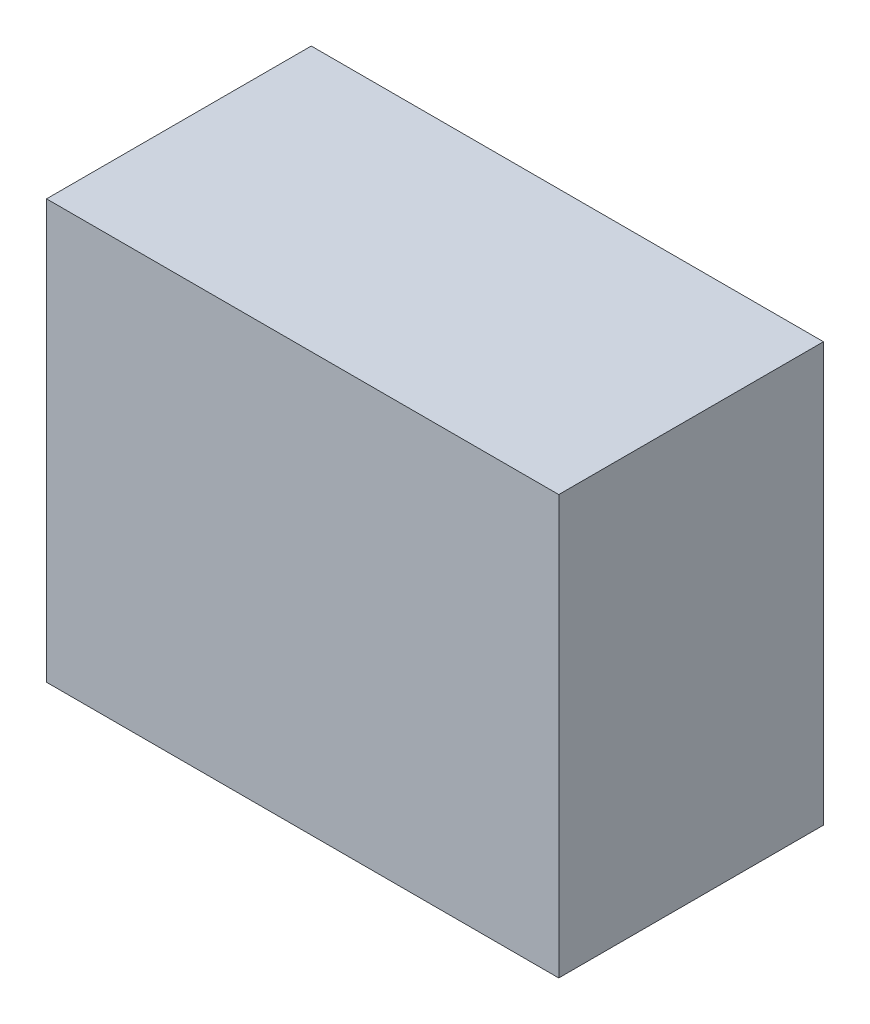
ISO-10303-21;
HEADER;
FILE_DESCRIPTION(('STEP AP214'),'2;1');
FILE_NAME('part.step','',(''),(''),'','','');
FILE_SCHEMA(('AUTOMOTIVE_DESIGN { 1 0 10303 214 1 1 1 1 }'));
ENDSEC;
DATA;
#1=APPLICATION_CONTEXT('core data for automotive mechanical design processes');
#2=APPLICATION_PROTOCOL_DEFINITION('international standard','automotive_design',2000,#1);
#3=PRODUCT_CONTEXT('',#1,'mechanical');
#4=PRODUCT('Part','Part','',(#3));
#5=PRODUCT_RELATED_PRODUCT_CATEGORY('part','',(#4));
#6=PRODUCT_DEFINITION_FORMATION('','',#4);
#7=PRODUCT_DEFINITION_CONTEXT('part definition',#1,'design');
#8=PRODUCT_DEFINITION('design','',#6,#7);
#9=PRODUCT_DEFINITION_SHAPE('','',#8);
#10=(LENGTH_UNIT() NAMED_UNIT(*) SI_UNIT(.MILLI.,.METRE.));
#11=(NAMED_UNIT(*) PLANE_ANGLE_UNIT() SI_UNIT($,.RADIAN.));
#12=(NAMED_UNIT(*) SI_UNIT($,.STERADIAN.) SOLID_ANGLE_UNIT());
#13=UNCERTAINTY_MEASURE_WITH_UNIT(LENGTH_MEASURE(1.E-05),#10,'distance_accuracy_value','');
#14=(GEOMETRIC_REPRESENTATION_CONTEXT(3) GLOBAL_UNCERTAINTY_ASSIGNED_CONTEXT((#13)) GLOBAL_UNIT_ASSIGNED_CONTEXT((#10,
#11,#12)) REPRESENTATION_CONTEXT('',''));
#15=CARTESIAN_POINT('',(0.,0.,0.));
#16=DIRECTION('',(0.,0.,1.));
#17=DIRECTION('',(1.,0.,0.));
#18=AXIS2_PLACEMENT_3D('',#15,#16,#17);
#19=CARTESIAN_POINT('',(-0.58050684,-0.47448978,0.));
#20=DIRECTION('',(-1.,0.,0.));
#21=DIRECTION('',(0.,1.,0.));
#22=AXIS2_PLACEMENT_3D('',#19,#20,#21);
#23=PLANE('',#22);
#24=DIRECTION('',(0.,0.,1.));
#25=VECTOR('',#24,1.);
#26=CARTESIAN_POINT('',(-0.58050684,-0.47448978,0.));
#27=LINE('',#26,#25);
#28=CARTESIAN_POINT('',(-0.58050684,-0.47448978,0.));
#29=VERTEX_POINT('',#28);
#30=CARTESIAN_POINT('',(-0.58050684,-0.47448978,0.5999988));
#31=VERTEX_POINT('',#30);
#32=EDGE_CURVE('E11',#29,#31,#27,.T.);
#33=ORIENTED_EDGE('',*,*,#32,.T.);
#34=DIRECTION('',(0.,1.,0.));
#35=VECTOR('',#34,1.);
#36=CARTESIAN_POINT('',(-0.58050684,-0.47448978,0.5999988));
#37=LINE('',#36,#35);
#38=CARTESIAN_POINT('',(-0.58050684,0.47449232,0.5999988));
#39=VERTEX_POINT('',#38);
#40=EDGE_CURVE('E23',#31,#39,#37,.T.);
#41=ORIENTED_EDGE('',*,*,#40,.T.);
#42=DIRECTION('',(0.,0.,1.));
#43=VECTOR('',#42,1.);
#44=CARTESIAN_POINT('',(-0.58050684,0.47449232,0.));
#45=LINE('',#44,#43);
#46=CARTESIAN_POINT('',(-0.58050684,0.47449232,0.));
#47=VERTEX_POINT('',#46);
#48=EDGE_CURVE('E84',#47,#39,#45,.T.);
#49=ORIENTED_EDGE('',*,*,#48,.F.);
#50=DIRECTION('',(0.,1.,0.));
#51=VECTOR('',#50,1.);
#52=CARTESIAN_POINT('',(-0.58050684,-0.47448978,0.));
#53=LINE('',#52,#51);
#54=EDGE_CURVE('E82',#29,#47,#53,.T.);
#55=ORIENTED_EDGE('',*,*,#54,.F.);
#56=EDGE_LOOP('',(#33,#41,#49,#55));
#57=FACE_BOUND('',#56,.T.);
#58=ADVANCED_FACE('F16',(#57),#23,.T.);
#59=CARTESIAN_POINT('',(-0.58050684,0.47449232,0.));
#60=DIRECTION('',(0.,1.,0.));
#61=DIRECTION('',(1.,0.,0.));
#62=AXIS2_PLACEMENT_3D('',#59,#60,#61);
#63=PLANE('',#62);
#64=ORIENTED_EDGE('',*,*,#48,.T.);
#65=DIRECTION('',(1.,0.,0.));
#66=VECTOR('',#65,1.);
#67=CARTESIAN_POINT('',(-0.58050684,0.47449232,0.5999988));
#68=LINE('',#67,#66);
#69=CARTESIAN_POINT('',(0.58050684,0.47449232,0.5999988));
#70=VERTEX_POINT('',#69);
#71=EDGE_CURVE('E80',#39,#70,#68,.T.);
#72=ORIENTED_EDGE('',*,*,#71,.T.);
#73=DIRECTION('',(0.,0.,1.));
#74=VECTOR('',#73,1.);
#75=CARTESIAN_POINT('',(0.58050684,0.47449232,0.));
#76=LINE('',#75,#74);
#77=CARTESIAN_POINT('',(0.58050684,0.47449232,0.));
#78=VERTEX_POINT('',#77);
#79=EDGE_CURVE('E78',#78,#70,#76,.T.);
#80=ORIENTED_EDGE('',*,*,#79,.F.);
#81=DIRECTION('',(1.,0.,0.));
#82=VECTOR('',#81,1.);
#83=CARTESIAN_POINT('',(-0.58050684,0.47449232,0.));
#84=LINE('',#83,#82);
#85=EDGE_CURVE('E69',#47,#78,#84,.T.);
#86=ORIENTED_EDGE('',*,*,#85,.F.);
#87=EDGE_LOOP('',(#64,#72,#80,#86));
#88=FACE_BOUND('',#87,.T.);
#89=ADVANCED_FACE('F89',(#88),#63,.T.);
#90=CARTESIAN_POINT('',(0.58050684,0.47449232,0.));
#91=DIRECTION('',(1.,0.,0.));
#92=DIRECTION('',(0.,-1.,0.));
#93=AXIS2_PLACEMENT_3D('',#90,#91,#92);
#94=PLANE('',#93);
#95=ORIENTED_EDGE('',*,*,#79,.T.);
#96=DIRECTION('',(0.,-1.,0.));
#97=VECTOR('',#96,1.);
#98=CARTESIAN_POINT('',(0.58050684,0.47449232,0.5999988));
#99=LINE('',#98,#97);
#100=CARTESIAN_POINT('',(0.58050684,-0.47448978,0.5999988));
#101=VERTEX_POINT('',#100);
#102=EDGE_CURVE('E59',#70,#101,#99,.T.);
#103=ORIENTED_EDGE('',*,*,#102,.T.);
#104=DIRECTION('',(0.,0.,1.));
#105=VECTOR('',#104,1.);
#106=CARTESIAN_POINT('',(0.58050684,-0.47448978,0.));
#107=LINE('',#106,#105);
#108=CARTESIAN_POINT('',(0.58050684,-0.47448978,0.));
#109=VERTEX_POINT('',#108);
#110=EDGE_CURVE('E53',#109,#101,#107,.T.);
#111=ORIENTED_EDGE('',*,*,#110,.F.);
#112=DIRECTION('',(0.,-1.,0.));
#113=VECTOR('',#112,1.);
#114=CARTESIAN_POINT('',(0.58050684,0.47449232,0.));
#115=LINE('',#114,#113);
#116=EDGE_CURVE('E57',#78,#109,#115,.T.);
#117=ORIENTED_EDGE('',*,*,#116,.F.);
#118=EDGE_LOOP('',(#95,#103,#111,#117));
#119=FACE_BOUND('',#118,.T.);
#120=ADVANCED_FACE('F56',(#119),#94,.T.);
#121=CARTESIAN_POINT('',(0.58050684,-0.47448978,0.));
#122=DIRECTION('',(0.,-1.,0.));
#123=DIRECTION('',(-1.,0.,0.));
#124=AXIS2_PLACEMENT_3D('',#121,#122,#123);
#125=PLANE('',#124);
#126=ORIENTED_EDGE('',*,*,#110,.T.);
#127=DIRECTION('',(-1.,0.,0.));
#128=VECTOR('',#127,1.);
#129=CARTESIAN_POINT('',(0.58050684,-0.47448978,0.5999988));
#130=LINE('',#129,#128);
#131=EDGE_CURVE('E70',#101,#31,#130,.T.);
#132=ORIENTED_EDGE('',*,*,#131,.T.);
#133=ORIENTED_EDGE('',*,*,#32,.F.);
#134=DIRECTION('',(-1.,0.,0.));
#135=VECTOR('',#134,1.);
#136=CARTESIAN_POINT('',(0.58050684,-0.47448978,0.));
#137=LINE('',#136,#135);
#138=EDGE_CURVE('E67',#109,#29,#137,.T.);
#139=ORIENTED_EDGE('',*,*,#138,.F.);
#140=EDGE_LOOP('',(#126,#132,#133,#139));
#141=FACE_BOUND('',#140,.T.);
#142=ADVANCED_FACE('F72',(#141),#125,.T.);
#143=CARTESIAN_POINT('',(-0.58050684,-0.47448978,0.));
#144=DIRECTION('',(0.,0.,1.));
#145=DIRECTION('',(1.,0.,0.));
#146=AXIS2_PLACEMENT_3D('',#143,#144,#145);
#147=PLANE('',#146);
#148=ORIENTED_EDGE('',*,*,#54,.T.);
#149=ORIENTED_EDGE('',*,*,#85,.T.);
#150=ORIENTED_EDGE('',*,*,#116,.T.);
#151=ORIENTED_EDGE('',*,*,#138,.T.);
#152=EDGE_LOOP('',(#148,#149,#150,#151));
#153=FACE_BOUND('',#152,.T.);
#154=ADVANCED_FACE('F66',(#153),#147,.F.);
#155=CARTESIAN_POINT('',(-0.58050684,-0.47448978,0.5999988));
#156=DIRECTION('',(0.,0.,1.));
#157=DIRECTION('',(1.,0.,0.));
#158=AXIS2_PLACEMENT_3D('',#155,#156,#157);
#159=PLANE('',#158);
#160=ORIENTED_EDGE('',*,*,#131,.F.);
#161=ORIENTED_EDGE('',*,*,#102,.F.);
#162=ORIENTED_EDGE('',*,*,#71,.F.);
#163=ORIENTED_EDGE('',*,*,#40,.F.);
#164=EDGE_LOOP('',(#160,#161,#162,#163));
#165=FACE_BOUND('',#164,.T.);
#166=ADVANCED_FACE('F90',(#165),#159,.T.);
#167=CLOSED_SHELL('',(#58,#89,#120,#142,#154,#166));
#168=MANIFOLD_SOLID_BREP('B1',#167);
#169=ADVANCED_BREP_SHAPE_REPRESENTATION('',(#18,#168),#14);
#170=SHAPE_DEFINITION_REPRESENTATION(#9,#169);
ENDSEC;
END-ISO-10303-21;
